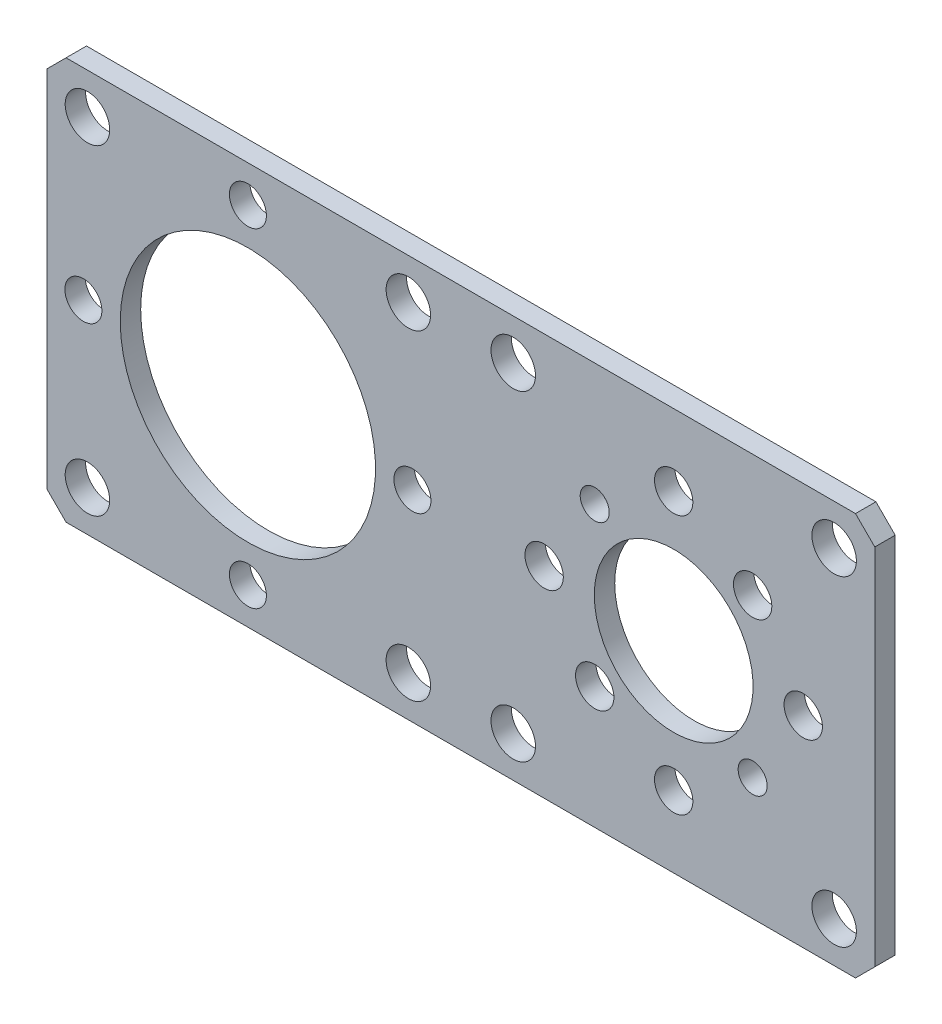
ISO-10303-21;
HEADER;
FILE_DESCRIPTION(('STEP AP214'),'2;1');
FILE_NAME('part.step','',(''),(''),'','','');
FILE_SCHEMA(('AUTOMOTIVE_DESIGN { 1 0 10303 214 1 1 1 1 }'));
ENDSEC;
DATA;
#1=APPLICATION_CONTEXT('core data for automotive mechanical design processes');
#2=APPLICATION_PROTOCOL_DEFINITION('international standard','automotive_design',2000,#1);
#3=PRODUCT_CONTEXT('',#1,'mechanical');
#4=PRODUCT('Part','Part','',(#3));
#5=PRODUCT_RELATED_PRODUCT_CATEGORY('part','',(#4));
#6=PRODUCT_DEFINITION_FORMATION('','',#4);
#7=PRODUCT_DEFINITION_CONTEXT('part definition',#1,'design');
#8=PRODUCT_DEFINITION('design','',#6,#7);
#9=PRODUCT_DEFINITION_SHAPE('','',#8);
#10=(LENGTH_UNIT() NAMED_UNIT(*) SI_UNIT(.MILLI.,.METRE.));
#11=(NAMED_UNIT(*) PLANE_ANGLE_UNIT() SI_UNIT($,.RADIAN.));
#12=(NAMED_UNIT(*) SI_UNIT($,.STERADIAN.) SOLID_ANGLE_UNIT());
#13=UNCERTAINTY_MEASURE_WITH_UNIT(LENGTH_MEASURE(1.E-05),#10,'distance_accuracy_value','');
#14=(GEOMETRIC_REPRESENTATION_CONTEXT(3) GLOBAL_UNCERTAINTY_ASSIGNED_CONTEXT((#13)) GLOBAL_UNIT_ASSIGNED_CONTEXT((#10,
#11,#12)) REPRESENTATION_CONTEXT('',''));
#15=CARTESIAN_POINT('',(0.,0.,0.));
#16=DIRECTION('',(0.,0.,1.));
#17=DIRECTION('',(1.,0.,0.));
#18=AXIS2_PLACEMENT_3D('',#15,#16,#17);
#19=CARTESIAN_POINT('',(-46.34075,22.51075,2.286));
#20=DIRECTION('',(0.,0.,1.));
#21=DIRECTION('',(1.,0.,0.));
#22=AXIS2_PLACEMENT_3D('',#19,#20,#21);
#23=PLANE('',#22);
#24=CARTESIAN_POINT('',(23.83,0.,2.286));
#25=DIRECTION('',(0.,0.,-1.));
#26=DIRECTION('',(-1.,0.,0.));
#27=AXIS2_PLACEMENT_3D('',#24,#25,#26);
#28=CIRCLE('',#27,8.88746);
#29=CARTESIAN_POINT('',(14.94254,0.,2.286));
#30=VERTEX_POINT('',#29);
#31=EDGE_CURVE('E167',#30,#30,#28,.T.);
#32=ORIENTED_EDGE('',*,*,#31,.T.);
#33=EDGE_LOOP('',(#32));
#34=FACE_BOUND('',#33,.T.);
#35=CARTESIAN_POINT('',(-23.83,0.,2.286));
#36=DIRECTION('',(0.,0.,-1.));
#37=DIRECTION('',(-1.,0.,0.));
#38=AXIS2_PLACEMENT_3D('',#35,#36,#37);
#39=CIRCLE('',#38,14.2875);
#40=CARTESIAN_POINT('',(-38.1175,0.,2.286));
#41=VERTEX_POINT('',#40);
#42=EDGE_CURVE('E170',#41,#41,#39,.T.);
#43=ORIENTED_EDGE('',*,*,#42,.T.);
#44=EDGE_LOOP('',(#43));
#45=FACE_BOUND('',#44,.T.);
#46=CARTESIAN_POINT('',(41.7905122421,17.9605122421,2.286));
#47=DIRECTION('',(0.,0.,1.));
#48=DIRECTION('',(1.,0.,0.));
#49=AXIS2_PLACEMENT_3D('',#46,#47,#48);
#50=CIRCLE('',#49,2.4892);
#51=CARTESIAN_POINT('',(44.2797122421,17.9605122421,2.286));
#52=VERTEX_POINT('',#51);
#53=EDGE_CURVE('E173',#52,#52,#50,.F.);
#54=ORIENTED_EDGE('',*,*,#53,.T.);
#55=EDGE_LOOP('',(#54));
#56=FACE_BOUND('',#55,.T.);
#57=CARTESIAN_POINT('',(41.7905122421,-17.9605122421,2.286));
#58=DIRECTION('',(0.,0.,1.));
#59=DIRECTION('',(1.,0.,0.));
#60=AXIS2_PLACEMENT_3D('',#57,#58,#59);
#61=CIRCLE('',#60,2.4892);
#62=CARTESIAN_POINT('',(44.2797122421,-17.9605122421,2.286));
#63=VERTEX_POINT('',#62);
#64=EDGE_CURVE('E176',#63,#63,#61,.F.);
#65=ORIENTED_EDGE('',*,*,#64,.T.);
#66=EDGE_LOOP('',(#65));
#67=FACE_BOUND('',#66,.T.);
#68=CARTESIAN_POINT('',(5.86948775786,-17.9605122421,2.286));
#69=DIRECTION('',(0.,0.,1.));
#70=DIRECTION('',(1.,0.,0.));
#71=AXIS2_PLACEMENT_3D('',#68,#69,#70);
#72=CIRCLE('',#71,2.4892);
#73=CARTESIAN_POINT('',(8.35868775786,-17.9605122421,2.286));
#74=VERTEX_POINT('',#73);
#75=EDGE_CURVE('E179',#74,#74,#72,.F.);
#76=ORIENTED_EDGE('',*,*,#75,.T.);
#77=EDGE_LOOP('',(#76));
#78=FACE_BOUND('',#77,.T.);
#79=CARTESIAN_POINT('',(5.86948775786,17.9605122421,2.286));
#80=DIRECTION('',(0.,0.,1.));
#81=DIRECTION('',(1.,0.,0.));
#82=AXIS2_PLACEMENT_3D('',#79,#80,#81);
#83=CIRCLE('',#82,2.4892);
#84=CARTESIAN_POINT('',(8.35868775786,17.9605122421,2.286));
#85=VERTEX_POINT('',#84);
#86=EDGE_CURVE('E182',#85,#85,#83,.F.);
#87=ORIENTED_EDGE('',*,*,#86,.T.);
#88=EDGE_LOOP('',(#87));
#89=FACE_BOUND('',#88,.T.);
#90=CARTESIAN_POINT('',(-41.7905122421,-17.9605122421,2.286));
#91=DIRECTION('',(0.,0.,1.));
#92=DIRECTION('',(1.,0.,0.));
#93=AXIS2_PLACEMENT_3D('',#90,#91,#92);
#94=CIRCLE('',#93,2.4892);
#95=CARTESIAN_POINT('',(-39.3013122421,-17.9605122421,2.286));
#96=VERTEX_POINT('',#95);
#97=EDGE_CURVE('E185',#96,#96,#94,.F.);
#98=ORIENTED_EDGE('',*,*,#97,.T.);
#99=EDGE_LOOP('',(#98));
#100=FACE_BOUND('',#99,.T.);
#101=CARTESIAN_POINT('',(-5.86948775786,17.9605122421,2.286));
#102=DIRECTION('',(0.,0.,1.));
#103=DIRECTION('',(1.,0.,0.));
#104=AXIS2_PLACEMENT_3D('',#101,#102,#103);
#105=CIRCLE('',#104,2.4892);
#106=CARTESIAN_POINT('',(-3.38028775786,17.9605122421,2.286));
#107=VERTEX_POINT('',#106);
#108=EDGE_CURVE('E188',#107,#107,#105,.F.);
#109=ORIENTED_EDGE('',*,*,#108,.T.);
#110=EDGE_LOOP('',(#109));
#111=FACE_BOUND('',#110,.T.);
#112=CARTESIAN_POINT('',(-5.86948775786,-17.9605122421,2.286));
#113=DIRECTION('',(0.,0.,1.));
#114=DIRECTION('',(1.,0.,0.));
#115=AXIS2_PLACEMENT_3D('',#112,#113,#114);
#116=CIRCLE('',#115,2.4892);
#117=CARTESIAN_POINT('',(-3.38028775786,-17.9605122421,2.286));
#118=VERTEX_POINT('',#117);
#119=EDGE_CURVE('E191',#118,#118,#116,.F.);
#120=ORIENTED_EDGE('',*,*,#119,.T.);
#121=EDGE_LOOP('',(#120));
#122=FACE_BOUND('',#121,.T.);
#123=CARTESIAN_POINT('',(-41.7905122421,17.9605122421,2.286));
#124=DIRECTION('',(0.,0.,1.));
#125=DIRECTION('',(1.,0.,0.));
#126=AXIS2_PLACEMENT_3D('',#123,#124,#125);
#127=CIRCLE('',#126,2.4892);
#128=CARTESIAN_POINT('',(-39.3013122421,17.9605122421,2.286));
#129=VERTEX_POINT('',#128);
#130=EDGE_CURVE('E194',#129,#129,#127,.F.);
#131=ORIENTED_EDGE('',*,*,#130,.T.);
#132=EDGE_LOOP('',(#131));
#133=FACE_BOUND('',#132,.T.);
#134=CARTESIAN_POINT('',(23.83,-14.5,2.286));
#135=DIRECTION('',(0.,0.,1.));
#136=DIRECTION('',(1.,0.,0.));
#137=AXIS2_PLACEMENT_3D('',#134,#135,#136);
#138=CIRCLE('',#137,2.1463);
#139=CARTESIAN_POINT('',(25.9763,-14.5,2.286));
#140=VERTEX_POINT('',#139);
#141=EDGE_CURVE('E197',#140,#140,#138,.F.);
#142=ORIENTED_EDGE('',*,*,#141,.T.);
#143=EDGE_LOOP('',(#142));
#144=FACE_BOUND('',#143,.T.);
#145=CARTESIAN_POINT('',(38.33,0.,2.286));
#146=DIRECTION('',(0.,0.,1.));
#147=DIRECTION('',(1.,0.,0.));
#148=AXIS2_PLACEMENT_3D('',#145,#146,#147);
#149=CIRCLE('',#148,2.1463);
#150=CARTESIAN_POINT('',(40.4763,0.,2.286));
#151=VERTEX_POINT('',#150);
#152=EDGE_CURVE('E200',#151,#151,#149,.F.);
#153=ORIENTED_EDGE('',*,*,#152,.T.);
#154=EDGE_LOOP('',(#153));
#155=FACE_BOUND('',#154,.T.);
#156=CARTESIAN_POINT('',(23.83,14.5,2.286));
#157=DIRECTION('',(0.,0.,1.));
#158=DIRECTION('',(1.,0.,0.));
#159=AXIS2_PLACEMENT_3D('',#156,#157,#158);
#160=CIRCLE('',#159,2.1463);
#161=CARTESIAN_POINT('',(25.9763,14.5,2.286));
#162=VERTEX_POINT('',#161);
#163=EDGE_CURVE('E203',#162,#162,#160,.F.);
#164=ORIENTED_EDGE('',*,*,#163,.T.);
#165=EDGE_LOOP('',(#164));
#166=FACE_BOUND('',#165,.T.);
#167=CARTESIAN_POINT('',(9.33,0.,2.286));
#168=DIRECTION('',(0.,0.,1.));
#169=DIRECTION('',(1.,0.,0.));
#170=AXIS2_PLACEMENT_3D('',#167,#168,#169);
#171=CIRCLE('',#170,2.1463);
#172=CARTESIAN_POINT('',(11.4763,0.,2.286));
#173=VERTEX_POINT('',#172);
#174=EDGE_CURVE('E206',#173,#173,#171,.F.);
#175=ORIENTED_EDGE('',*,*,#174,.T.);
#176=EDGE_LOOP('',(#175));
#177=FACE_BOUND('',#176,.T.);
#178=CARTESIAN_POINT('',(14.9911652352,8.83883476483,2.286));
#179=DIRECTION('',(0.,0.,1.));
#180=DIRECTION('',(1.,0.,0.));
#181=AXIS2_PLACEMENT_3D('',#178,#179,#180);
#182=CIRCLE('',#181,1.6256);
#183=CARTESIAN_POINT('',(16.6167652352,8.83883476483,2.286));
#184=VERTEX_POINT('',#183);
#185=EDGE_CURVE('E209',#184,#184,#182,.F.);
#186=ORIENTED_EDGE('',*,*,#185,.T.);
#187=EDGE_LOOP('',(#186));
#188=FACE_BOUND('',#187,.T.);
#189=CARTESIAN_POINT('',(32.6688347648,-8.83883476483,2.286));
#190=DIRECTION('',(0.,0.,1.));
#191=DIRECTION('',(1.,0.,0.));
#192=AXIS2_PLACEMENT_3D('',#189,#190,#191);
#193=CIRCLE('',#192,1.6256);
#194=CARTESIAN_POINT('',(34.2944347648,-8.83883476483,2.286));
#195=VERTEX_POINT('',#194);
#196=EDGE_CURVE('E212',#195,#195,#193,.F.);
#197=ORIENTED_EDGE('',*,*,#196,.T.);
#198=EDGE_LOOP('',(#197));
#199=FACE_BOUND('',#198,.T.);
#200=CARTESIAN_POINT('',(14.9911652352,-8.83883476483,2.286));
#201=DIRECTION('',(0.,0.,1.));
#202=DIRECTION('',(1.,0.,0.));
#203=AXIS2_PLACEMENT_3D('',#200,#201,#202);
#204=CIRCLE('',#203,2.1463);
#205=CARTESIAN_POINT('',(17.1374652352,-8.83883476483,2.286));
#206=VERTEX_POINT('',#205);
#207=EDGE_CURVE('E215',#206,#206,#204,.F.);
#208=ORIENTED_EDGE('',*,*,#207,.T.);
#209=EDGE_LOOP('',(#208));
#210=FACE_BOUND('',#209,.T.);
#211=CARTESIAN_POINT('',(32.6688347648,8.83883476483,2.286));
#212=DIRECTION('',(0.,0.,1.));
#213=DIRECTION('',(1.,0.,0.));
#214=AXIS2_PLACEMENT_3D('',#211,#212,#213);
#215=CIRCLE('',#214,2.1463);
#216=CARTESIAN_POINT('',(34.8151347648,8.83883476483,2.286));
#217=VERTEX_POINT('',#216);
#218=EDGE_CURVE('E218',#217,#217,#215,.F.);
#219=ORIENTED_EDGE('',*,*,#218,.T.);
#220=EDGE_LOOP('',(#219));
#221=FACE_BOUND('',#220,.T.);
#222=CARTESIAN_POINT('',(-23.83,-18.415,2.286));
#223=DIRECTION('',(0.,0.,1.));
#224=DIRECTION('',(1.,0.,0.));
#225=AXIS2_PLACEMENT_3D('',#222,#223,#224);
#226=CIRCLE('',#225,2.0701);
#227=CARTESIAN_POINT('',(-21.7599,-18.415,2.286));
#228=VERTEX_POINT('',#227);
#229=EDGE_CURVE('E221',#228,#228,#226,.F.);
#230=ORIENTED_EDGE('',*,*,#229,.T.);
#231=EDGE_LOOP('',(#230));
#232=FACE_BOUND('',#231,.T.);
#233=CARTESIAN_POINT('',(-23.83,18.415,2.286));
#234=DIRECTION('',(0.,0.,1.));
#235=DIRECTION('',(1.,0.,0.));
#236=AXIS2_PLACEMENT_3D('',#233,#234,#235);
#237=CIRCLE('',#236,2.0701);
#238=CARTESIAN_POINT('',(-21.7599,18.415,2.286));
#239=VERTEX_POINT('',#238);
#240=EDGE_CURVE('E224',#239,#239,#237,.F.);
#241=ORIENTED_EDGE('',*,*,#240,.T.);
#242=EDGE_LOOP('',(#241));
#243=FACE_BOUND('',#242,.T.);
#244=CARTESIAN_POINT('',(-5.415,0.,2.286));
#245=DIRECTION('',(0.,0.,1.));
#246=DIRECTION('',(1.,0.,0.));
#247=AXIS2_PLACEMENT_3D('',#244,#245,#246);
#248=CIRCLE('',#247,2.0701);
#249=CARTESIAN_POINT('',(-3.3449,0.,2.286));
#250=VERTEX_POINT('',#249);
#251=EDGE_CURVE('E226',#250,#250,#248,.F.);
#252=ORIENTED_EDGE('',*,*,#251,.T.);
#253=EDGE_LOOP('',(#252));
#254=FACE_BOUND('',#253,.T.);
#255=CARTESIAN_POINT('',(-42.245,0.,2.286));
#256=DIRECTION('',(0.,0.,1.));
#257=DIRECTION('',(1.,0.,0.));
#258=AXIS2_PLACEMENT_3D('',#255,#256,#257);
#259=CIRCLE('',#258,2.0701);
#260=CARTESIAN_POINT('',(-40.1749,0.,2.286));
#261=VERTEX_POINT('',#260);
#262=EDGE_CURVE('E20',#261,#261,#259,.F.);
#263=ORIENTED_EDGE('',*,*,#262,.T.);
#264=EDGE_LOOP('',(#263));
#265=FACE_BOUND('',#264,.T.);
#266=DIRECTION('',(0.,1.,0.));
#267=VECTOR('',#266,1.);
#268=CARTESIAN_POINT('',(-46.34075,22.51075,2.286));
#269=LINE('',#268,#267);
#270=CARTESIAN_POINT('',(-46.34075,20.35175,2.286));
#271=VERTEX_POINT('',#270);
#272=CARTESIAN_POINT('',(-46.3407499999125,-20.3517500006125,2.286));
#273=VERTEX_POINT('',#272);
#274=EDGE_CURVE('E255',#271,#273,#269,.F.);
#275=ORIENTED_EDGE('',*,*,#274,.T.);
#276=DIRECTION('',(-0.707106781186548,0.707106781186548,0.));
#277=VECTOR('',#276,1.);
#278=CARTESIAN_POINT('',(-44.18175,-22.51075,2.286));
#279=LINE('',#278,#277);
#280=CARTESIAN_POINT('',(-44.18175,-22.51075,2.286));
#281=VERTEX_POINT('',#280);
#282=EDGE_CURVE('E250',#273,#281,#279,.F.);
#283=ORIENTED_EDGE('',*,*,#282,.T.);
#284=DIRECTION('',(-1.,0.,0.));
#285=VECTOR('',#284,1.);
#286=CARTESIAN_POINT('',(-46.34075,-22.51075,2.286));
#287=LINE('',#286,#285);
#288=CARTESIAN_POINT('',(44.1817500007875,-22.5107499998875,2.286));
#289=VERTEX_POINT('',#288);
#290=EDGE_CURVE('E245',#281,#289,#287,.F.);
#291=ORIENTED_EDGE('',*,*,#290,.T.);
#292=DIRECTION('',(-0.707106781186548,-0.707106781186548,0.));
#293=VECTOR('',#292,1.);
#294=CARTESIAN_POINT('',(46.34075,-20.35175,2.286));
#295=LINE('',#294,#293);
#296=CARTESIAN_POINT('',(46.340749999825,-20.351750000525,2.286));
#297=VERTEX_POINT('',#296);
#298=EDGE_CURVE('E240',#289,#297,#295,.F.);
#299=ORIENTED_EDGE('',*,*,#298,.T.);
#300=DIRECTION('',(0.,1.,0.));
#301=VECTOR('',#300,1.);
#302=CARTESIAN_POINT('',(46.34075,22.51075,2.286));
#303=LINE('',#302,#301);
#304=CARTESIAN_POINT('',(46.34075,20.35175,2.286));
#305=VERTEX_POINT('',#304);
#306=EDGE_CURVE('E84',#297,#305,#303,.T.);
#307=ORIENTED_EDGE('',*,*,#306,.T.);
#308=DIRECTION('',(0.707106781186548,-0.707106781186548,0.));
#309=VECTOR('',#308,1.);
#310=CARTESIAN_POINT('',(44.18175,22.51075,2.286));
#311=LINE('',#310,#309);
#312=CARTESIAN_POINT('',(44.181750000675,22.510749999775,2.286));
#313=VERTEX_POINT('',#312);
#314=EDGE_CURVE('E83',#305,#313,#311,.F.);
#315=ORIENTED_EDGE('',*,*,#314,.T.);
#316=DIRECTION('',(1.,0.,0.));
#317=VECTOR('',#316,1.);
#318=CARTESIAN_POINT('',(-46.34075,22.51075,2.286));
#319=LINE('',#318,#317);
#320=CARTESIAN_POINT('',(-44.18175,22.51075,2.286));
#321=VERTEX_POINT('',#320);
#322=EDGE_CURVE('E80',#313,#321,#319,.F.);
#323=ORIENTED_EDGE('',*,*,#322,.T.);
#324=DIRECTION('',(0.707106781186548,0.707106781186548,0.));
#325=VECTOR('',#324,1.);
#326=CARTESIAN_POINT('',(-46.34075,20.35175,2.286));
#327=LINE('',#326,#325);
#328=EDGE_CURVE('E260',#321,#271,#327,.F.);
#329=ORIENTED_EDGE('',*,*,#328,.T.);
#330=EDGE_LOOP('',(#275,#283,#291,#299,#307,#315,#323,#329));
#331=FACE_BOUND('',#330,.T.);
#332=ADVANCED_FACE('F17',(#34,#45,#56,#67,#78,#89,#100,#111,#122,#133,#144,#155,#166,#177,#188,
#199,#210,#221,#232,#243,#254,#265,#331),#23,.T.);
#333=CARTESIAN_POINT('',(44.18175,22.51075,2.286));
#334=DIRECTION('',(-0.707106781186548,-0.707106781186548,0.));
#335=DIRECTION('',(0.707106781186548,-0.707106781186548,0.));
#336=AXIS2_PLACEMENT_3D('',#333,#334,#335);
#337=PLANE('',#336);
#338=DIRECTION('',(0.,0.,1.));
#339=VECTOR('',#338,1.);
#340=CARTESIAN_POINT('',(46.34075,20.35175,2.286));
#341=LINE('',#340,#339);
#342=CARTESIAN_POINT('',(46.34075,20.35175,-2.34694100091637E-10));
#343=VERTEX_POINT('',#342);
#344=EDGE_CURVE('E234',#305,#343,#341,.F.);
#345=ORIENTED_EDGE('',*,*,#344,.T.);
#346=DIRECTION('',(-0.707106781039163,0.707106781333932,0.));
#347=VECTOR('',#346,1.);
#348=CARTESIAN_POINT('',(46.34075,20.35175,0.));
#349=LINE('',#348,#347);
#350=CARTESIAN_POINT('',(44.181750000675,22.510749999775,-2.34693883251202E-10));
#351=VERTEX_POINT('',#350);
#352=EDGE_CURVE('E100',#343,#351,#349,.T.);
#353=ORIENTED_EDGE('',*,*,#352,.T.);
#354=DIRECTION('',(0.,0.,1.));
#355=VECTOR('',#354,1.);
#356=CARTESIAN_POINT('',(44.1817500009,22.51075,2.286));
#357=LINE('',#356,#355);
#358=EDGE_CURVE('E89',#351,#313,#357,.T.);
#359=ORIENTED_EDGE('',*,*,#358,.T.);
#360=ORIENTED_EDGE('',*,*,#314,.F.);
#361=EDGE_LOOP('',(#345,#353,#359,#360));
#362=FACE_BOUND('',#361,.T.);
#363=ADVANCED_FACE('F99',(#362),#337,.F.);
#364=CARTESIAN_POINT('',(-46.34075,22.51075,2.286));
#365=DIRECTION('',(0.,-1.,0.));
#366=DIRECTION('',(1.,0.,0.));
#367=AXIS2_PLACEMENT_3D('',#364,#365,#366);
#368=PLANE('',#367);
#369=ORIENTED_EDGE('',*,*,#358,.F.);
#370=DIRECTION('',(1.,0.,0.));
#371=VECTOR('',#370,1.);
#372=CARTESIAN_POINT('',(-46.34075,22.51075,0.));
#373=LINE('',#372,#371);
#374=CARTESIAN_POINT('',(-44.18175,22.51075,-2.34693774830985E-10));
#375=VERTEX_POINT('',#374);
#376=EDGE_CURVE('E274',#351,#375,#373,.F.);
#377=ORIENTED_EDGE('',*,*,#376,.T.);
#378=DIRECTION('',(0.,0.,1.));
#379=VECTOR('',#378,1.);
#380=CARTESIAN_POINT('',(-44.18175,22.51075,2.286));
#381=LINE('',#380,#379);
#382=EDGE_CURVE('E96',#375,#321,#381,.T.);
#383=ORIENTED_EDGE('',*,*,#382,.T.);
#384=ORIENTED_EDGE('',*,*,#322,.F.);
#385=EDGE_LOOP('',(#369,#377,#383,#384));
#386=FACE_BOUND('',#385,.T.);
#387=ADVANCED_FACE('F93',(#386),#368,.F.);
#388=CARTESIAN_POINT('',(-46.34075,20.35175,2.286));
#389=DIRECTION('',(0.707106781186548,-0.707106781186548,0.));
#390=DIRECTION('',(0.707106781186548,0.707106781186548,0.));
#391=AXIS2_PLACEMENT_3D('',#388,#389,#390);
#392=PLANE('',#391);
#393=ORIENTED_EDGE('',*,*,#382,.F.);
#394=DIRECTION('',(-0.707106781186547,-0.707106781186548,0.));
#395=VECTOR('',#394,1.);
#396=CARTESIAN_POINT('',(-44.18175,22.51075,0.));
#397=LINE('',#396,#395);
#398=CARTESIAN_POINT('',(-46.34075,20.35175,-2.34693883251202E-10));
#399=VERTEX_POINT('',#398);
#400=EDGE_CURVE('E271',#375,#399,#397,.T.);
#401=ORIENTED_EDGE('',*,*,#400,.T.);
#402=DIRECTION('',(0.,0.,-1.));
#403=VECTOR('',#402,1.);
#404=CARTESIAN_POINT('',(-46.34075,20.35175,2.286));
#405=LINE('',#404,#403);
#406=EDGE_CURVE('E257',#399,#271,#405,.F.);
#407=ORIENTED_EDGE('',*,*,#406,.T.);
#408=ORIENTED_EDGE('',*,*,#328,.F.);
#409=EDGE_LOOP('',(#393,#401,#407,#408));
#410=FACE_BOUND('',#409,.T.);
#411=ADVANCED_FACE('F269',(#410),#392,.F.);
#412=CARTESIAN_POINT('',(-46.34075,22.51075,2.286));
#413=DIRECTION('',(1.,0.,0.));
#414=DIRECTION('',(0.,0.,-1.));
#415=AXIS2_PLACEMENT_3D('',#412,#413,#414);
#416=PLANE('',#415);
#417=DIRECTION('',(0.,0.,1.));
#418=VECTOR('',#417,1.);
#419=CARTESIAN_POINT('',(-46.34074999965,-20.35175000035,2.286));
#420=LINE('',#419,#418);
#421=CARTESIAN_POINT('',(-46.3407499999125,-20.3517500006125,-2.34693774830985E-10));
#422=VERTEX_POINT('',#421);
#423=EDGE_CURVE('E252',#422,#273,#420,.T.);
#424=ORIENTED_EDGE('',*,*,#423,.T.);
#425=ORIENTED_EDGE('',*,*,#274,.F.);
#426=ORIENTED_EDGE('',*,*,#406,.F.);
#427=DIRECTION('',(0.,1.,0.));
#428=VECTOR('',#427,1.);
#429=CARTESIAN_POINT('',(-46.34075,22.51075,0.));
#430=LINE('',#429,#428);
#431=EDGE_CURVE('E273',#399,#422,#430,.F.);
#432=ORIENTED_EDGE('',*,*,#431,.T.);
#433=EDGE_LOOP('',(#424,#425,#426,#432));
#434=FACE_BOUND('',#433,.T.);
#435=ADVANCED_FACE('F265',(#434),#416,.F.);
#436=CARTESIAN_POINT('',(-44.18175,-22.51075,2.286));
#437=DIRECTION('',(0.707106781186548,0.707106781186548,0.));
#438=DIRECTION('',(-0.707106781186548,0.707106781186548,0.));
#439=AXIS2_PLACEMENT_3D('',#436,#437,#438);
#440=PLANE('',#439);
#441=ORIENTED_EDGE('',*,*,#423,.F.);
#442=DIRECTION('',(0.707106781301178,-0.707106781071916,0.));
#443=VECTOR('',#442,1.);
#444=CARTESIAN_POINT('',(-46.34075,-20.3517500007,0.));
#445=LINE('',#444,#443);
#446=CARTESIAN_POINT('',(-44.18175,-22.51075,-2.34693883251202E-10));
#447=VERTEX_POINT('',#446);
#448=EDGE_CURVE('E276',#422,#447,#445,.T.);
#449=ORIENTED_EDGE('',*,*,#448,.T.);
#450=DIRECTION('',(0.,0.,1.));
#451=VECTOR('',#450,1.);
#452=CARTESIAN_POINT('',(-44.18175,-22.51075,2.286));
#453=LINE('',#452,#451);
#454=EDGE_CURVE('E247',#447,#281,#453,.T.);
#455=ORIENTED_EDGE('',*,*,#454,.T.);
#456=ORIENTED_EDGE('',*,*,#282,.F.);
#457=EDGE_LOOP('',(#441,#449,#455,#456));
#458=FACE_BOUND('',#457,.T.);
#459=ADVANCED_FACE('F299',(#458),#440,.F.);
#460=CARTESIAN_POINT('',(-46.34075,-22.51075,2.286));
#461=DIRECTION('',(0.,1.,0.));
#462=DIRECTION('',(-1.,0.,0.));
#463=AXIS2_PLACEMENT_3D('',#460,#461,#462);
#464=PLANE('',#463);
#465=DIRECTION('',(0.,0.,1.));
#466=VECTOR('',#465,1.);
#467=CARTESIAN_POINT('',(44.18175000045,-22.51074999955,2.286));
#468=LINE('',#467,#466);
#469=CARTESIAN_POINT('',(44.1817500007875,-22.5107499998875,-2.34693774830985E-10));
#470=VERTEX_POINT('',#469);
#471=EDGE_CURVE('E242',#470,#289,#468,.T.);
#472=ORIENTED_EDGE('',*,*,#471,.T.);
#473=ORIENTED_EDGE('',*,*,#290,.F.);
#474=ORIENTED_EDGE('',*,*,#454,.F.);
#475=DIRECTION('',(1.,0.,0.));
#476=VECTOR('',#475,1.);
#477=CARTESIAN_POINT('',(-46.34075,-22.51075,0.));
#478=LINE('',#477,#476);
#479=EDGE_CURVE('E281',#447,#470,#478,.T.);
#480=ORIENTED_EDGE('',*,*,#479,.T.);
#481=EDGE_LOOP('',(#472,#473,#474,#480));
#482=FACE_BOUND('',#481,.T.);
#483=ADVANCED_FACE('F296',(#482),#464,.F.);
#484=CARTESIAN_POINT('',(46.34075,-20.35175,2.286));
#485=DIRECTION('',(-0.707106781186548,0.707106781186548,0.));
#486=DIRECTION('',(-0.707106781186548,-0.707106781186548,0.));
#487=AXIS2_PLACEMENT_3D('',#484,#485,#486);
#488=PLANE('',#487);
#489=ORIENTED_EDGE('',*,*,#471,.F.);
#490=DIRECTION('',(0.707106781153795,0.7071067812193,0.));
#491=VECTOR('',#490,1.);
#492=CARTESIAN_POINT('',(44.1817500009,-22.51075,0.));
#493=LINE('',#492,#491);
#494=CARTESIAN_POINT('',(46.340749999825,-20.351750000525,-2.34693883251202E-10));
#495=VERTEX_POINT('',#494);
#496=EDGE_CURVE('E284',#470,#495,#493,.T.);
#497=ORIENTED_EDGE('',*,*,#496,.T.);
#498=DIRECTION('',(0.,0.,1.));
#499=VECTOR('',#498,1.);
#500=CARTESIAN_POINT('',(46.34075,-20.3517500007,2.286));
#501=LINE('',#500,#499);
#502=EDGE_CURVE('E35',#495,#297,#501,.T.);
#503=ORIENTED_EDGE('',*,*,#502,.T.);
#504=ORIENTED_EDGE('',*,*,#298,.F.);
#505=EDGE_LOOP('',(#489,#497,#503,#504));
#506=FACE_BOUND('',#505,.T.);
#507=ADVANCED_FACE('F292',(#506),#488,.F.);
#508=CARTESIAN_POINT('',(46.34075,22.51075,2.286));
#509=DIRECTION('',(-1.,0.,0.));
#510=DIRECTION('',(0.,0.,1.));
#511=AXIS2_PLACEMENT_3D('',#508,#509,#510);
#512=PLANE('',#511);
#513=ORIENTED_EDGE('',*,*,#502,.F.);
#514=DIRECTION('',(0.,1.,0.));
#515=VECTOR('',#514,1.);
#516=CARTESIAN_POINT('',(46.34075,22.51075,0.));
#517=LINE('',#516,#515);
#518=EDGE_CURVE('E166',#495,#343,#517,.T.);
#519=ORIENTED_EDGE('',*,*,#518,.T.);
#520=ORIENTED_EDGE('',*,*,#344,.F.);
#521=ORIENTED_EDGE('',*,*,#306,.F.);
#522=EDGE_LOOP('',(#513,#519,#520,#521));
#523=FACE_BOUND('',#522,.T.);
#524=ADVANCED_FACE('F287',(#523),#512,.F.);
#525=CARTESIAN_POINT('',(-42.245,0.,2.286));
#526=DIRECTION('',(0.,0.,1.));
#527=DIRECTION('',(1.,0.,0.));
#528=AXIS2_PLACEMENT_3D('',#525,#526,#527);
#529=CYLINDRICAL_SURFACE('',#528,2.0701);
#530=CARTESIAN_POINT('',(-42.245,0.,-3.12924599427111E-10));
#531=DIRECTION('',(0.,0.,1.));
#532=DIRECTION('',(1.,0.,0.));
#533=AXIS2_PLACEMENT_3D('',#530,#531,#532);
#534=CIRCLE('',#533,2.0701);
#535=CARTESIAN_POINT('',(-40.1749,0.,-3.12924599427111E-10));
#536=VERTEX_POINT('',#535);
#537=EDGE_CURVE('E163',#536,#536,#534,.F.);
#538=ORIENTED_EDGE('',*,*,#537,.T.);
#539=EDGE_LOOP('',(#538));
#540=FACE_BOUND('',#539,.T.);
#541=ORIENTED_EDGE('',*,*,#262,.F.);
#542=EDGE_LOOP('',(#541));
#543=FACE_BOUND('',#542,.T.);
#544=ADVANCED_FACE('F400',(#540,#543),#529,.F.);
#545=CARTESIAN_POINT('',(-5.415,0.,2.286));
#546=DIRECTION('',(0.,0.,1.));
#547=DIRECTION('',(1.,0.,0.));
#548=AXIS2_PLACEMENT_3D('',#545,#546,#547);
#549=CYLINDRICAL_SURFACE('',#548,2.0701);
#550=CARTESIAN_POINT('',(-5.415,0.,-3.12924599427111E-10));
#551=DIRECTION('',(0.,0.,1.));
#552=DIRECTION('',(1.,0.,0.));
#553=AXIS2_PLACEMENT_3D('',#550,#551,#552);
#554=CIRCLE('',#553,2.0701);
#555=CARTESIAN_POINT('',(-3.3449,0.,-3.12924599427111E-10));
#556=VERTEX_POINT('',#555);
#557=EDGE_CURVE('E160',#556,#556,#554,.F.);
#558=ORIENTED_EDGE('',*,*,#557,.T.);
#559=EDGE_LOOP('',(#558));
#560=FACE_BOUND('',#559,.T.);
#561=ORIENTED_EDGE('',*,*,#251,.F.);
#562=EDGE_LOOP('',(#561));
#563=FACE_BOUND('',#562,.T.);
#564=ADVANCED_FACE('F396',(#560,#563),#549,.F.);
#565=CARTESIAN_POINT('',(-23.83,18.415,2.286));
#566=DIRECTION('',(0.,0.,1.));
#567=DIRECTION('',(1.,0.,0.));
#568=AXIS2_PLACEMENT_3D('',#565,#566,#567);
#569=CYLINDRICAL_SURFACE('',#568,2.0701);
#570=CARTESIAN_POINT('',(-23.83,18.415,-3.12924599427111E-10));
#571=DIRECTION('',(0.,0.,1.));
#572=DIRECTION('',(1.,0.,0.));
#573=AXIS2_PLACEMENT_3D('',#570,#571,#572);
#574=CIRCLE('',#573,2.0701);
#575=CARTESIAN_POINT('',(-21.7599,18.415,-3.12924599427111E-10));
#576=VERTEX_POINT('',#575);
#577=EDGE_CURVE('E157',#576,#576,#574,.F.);
#578=ORIENTED_EDGE('',*,*,#577,.T.);
#579=EDGE_LOOP('',(#578));
#580=FACE_BOUND('',#579,.T.);
#581=ORIENTED_EDGE('',*,*,#240,.F.);
#582=EDGE_LOOP('',(#581));
#583=FACE_BOUND('',#582,.T.);
#584=ADVANCED_FACE('F392',(#580,#583),#569,.F.);
#585=CARTESIAN_POINT('',(-23.83,-18.415,2.286));
#586=DIRECTION('',(0.,0.,1.));
#587=DIRECTION('',(1.,0.,0.));
#588=AXIS2_PLACEMENT_3D('',#585,#586,#587);
#589=CYLINDRICAL_SURFACE('',#588,2.0701);
#590=CARTESIAN_POINT('',(-23.83,-18.415,-3.12924599427111E-10));
#591=DIRECTION('',(0.,0.,1.));
#592=DIRECTION('',(1.,0.,0.));
#593=AXIS2_PLACEMENT_3D('',#590,#591,#592);
#594=CIRCLE('',#593,2.0701);
#595=CARTESIAN_POINT('',(-21.7599,-18.415,-3.12924599427111E-10));
#596=VERTEX_POINT('',#595);
#597=EDGE_CURVE('E154',#596,#596,#594,.F.);
#598=ORIENTED_EDGE('',*,*,#597,.T.);
#599=EDGE_LOOP('',(#598));
#600=FACE_BOUND('',#599,.T.);
#601=ORIENTED_EDGE('',*,*,#229,.F.);
#602=EDGE_LOOP('',(#601));
#603=FACE_BOUND('',#602,.T.);
#604=ADVANCED_FACE('F388',(#600,#603),#589,.F.);
#605=CARTESIAN_POINT('',(32.6688347648,8.83883476483,2.286));
#606=DIRECTION('',(0.,0.,1.));
#607=DIRECTION('',(1.,0.,0.));
#608=AXIS2_PLACEMENT_3D('',#605,#606,#607);
#609=CYLINDRICAL_SURFACE('',#608,2.1463);
#610=CARTESIAN_POINT('',(32.6688347648,8.83883476483,-3.12924599427111E-10));
#611=DIRECTION('',(0.,0.,1.));
#612=DIRECTION('',(1.,0.,0.));
#613=AXIS2_PLACEMENT_3D('',#610,#611,#612);
#614=CIRCLE('',#613,2.1463);
#615=CARTESIAN_POINT('',(34.8151347648,8.83883476483,-3.12924599427111E-10));
#616=VERTEX_POINT('',#615);
#617=EDGE_CURVE('E151',#616,#616,#614,.F.);
#618=ORIENTED_EDGE('',*,*,#617,.T.);
#619=EDGE_LOOP('',(#618));
#620=FACE_BOUND('',#619,.T.);
#621=ORIENTED_EDGE('',*,*,#218,.F.);
#622=EDGE_LOOP('',(#621));
#623=FACE_BOUND('',#622,.T.);
#624=ADVANCED_FACE('F384',(#620,#623),#609,.F.);
#625=CARTESIAN_POINT('',(14.9911652352,-8.83883476483,2.286));
#626=DIRECTION('',(0.,0.,1.));
#627=DIRECTION('',(1.,0.,0.));
#628=AXIS2_PLACEMENT_3D('',#625,#626,#627);
#629=CYLINDRICAL_SURFACE('',#628,2.1463);
#630=CARTESIAN_POINT('',(14.9911652352,-8.83883476483,-3.12924599427111E-10));
#631=DIRECTION('',(0.,0.,1.));
#632=DIRECTION('',(1.,0.,0.));
#633=AXIS2_PLACEMENT_3D('',#630,#631,#632);
#634=CIRCLE('',#633,2.1463);
#635=CARTESIAN_POINT('',(17.1374652352,-8.83883476483,-3.12924599427111E-10));
#636=VERTEX_POINT('',#635);
#637=EDGE_CURVE('E148',#636,#636,#634,.F.);
#638=ORIENTED_EDGE('',*,*,#637,.T.);
#639=EDGE_LOOP('',(#638));
#640=FACE_BOUND('',#639,.T.);
#641=ORIENTED_EDGE('',*,*,#207,.F.);
#642=EDGE_LOOP('',(#641));
#643=FACE_BOUND('',#642,.T.);
#644=ADVANCED_FACE('F380',(#640,#643),#629,.F.);
#645=CARTESIAN_POINT('',(32.6688347648,-8.83883476483,2.286));
#646=DIRECTION('',(0.,0.,1.));
#647=DIRECTION('',(1.,0.,0.));
#648=AXIS2_PLACEMENT_3D('',#645,#646,#647);
#649=CYLINDRICAL_SURFACE('',#648,1.6256);
#650=CARTESIAN_POINT('',(32.6688347648,-8.83883476483,-3.12924599427111E-10));
#651=DIRECTION('',(0.,0.,1.));
#652=DIRECTION('',(1.,0.,0.));
#653=AXIS2_PLACEMENT_3D('',#650,#651,#652);
#654=CIRCLE('',#653,1.6256);
#655=CARTESIAN_POINT('',(34.2944347648,-8.83883476483,-3.12924599427111E-10));
#656=VERTEX_POINT('',#655);
#657=EDGE_CURVE('E145',#656,#656,#654,.F.);
#658=ORIENTED_EDGE('',*,*,#657,.T.);
#659=EDGE_LOOP('',(#658));
#660=FACE_BOUND('',#659,.T.);
#661=ORIENTED_EDGE('',*,*,#196,.F.);
#662=EDGE_LOOP('',(#661));
#663=FACE_BOUND('',#662,.T.);
#664=ADVANCED_FACE('F376',(#660,#663),#649,.F.);
#665=CARTESIAN_POINT('',(14.9911652352,8.83883476483,2.286));
#666=DIRECTION('',(0.,0.,1.));
#667=DIRECTION('',(1.,0.,0.));
#668=AXIS2_PLACEMENT_3D('',#665,#666,#667);
#669=CYLINDRICAL_SURFACE('',#668,1.6256);
#670=CARTESIAN_POINT('',(14.9911652352,8.83883476483,-3.12924599427111E-10));
#671=DIRECTION('',(0.,0.,1.));
#672=DIRECTION('',(1.,0.,0.));
#673=AXIS2_PLACEMENT_3D('',#670,#671,#672);
#674=CIRCLE('',#673,1.6256);
#675=CARTESIAN_POINT('',(16.6167652352,8.83883476483,-3.12924599427111E-10));
#676=VERTEX_POINT('',#675);
#677=EDGE_CURVE('E142',#676,#676,#674,.F.);
#678=ORIENTED_EDGE('',*,*,#677,.T.);
#679=EDGE_LOOP('',(#678));
#680=FACE_BOUND('',#679,.T.);
#681=ORIENTED_EDGE('',*,*,#185,.F.);
#682=EDGE_LOOP('',(#681));
#683=FACE_BOUND('',#682,.T.);
#684=ADVANCED_FACE('F372',(#680,#683),#669,.F.);
#685=CARTESIAN_POINT('',(9.33,0.,2.286));
#686=DIRECTION('',(0.,0.,1.));
#687=DIRECTION('',(1.,0.,0.));
#688=AXIS2_PLACEMENT_3D('',#685,#686,#687);
#689=CYLINDRICAL_SURFACE('',#688,2.1463);
#690=CARTESIAN_POINT('',(9.33,0.,-3.12924599427111E-10));
#691=DIRECTION('',(0.,0.,1.));
#692=DIRECTION('',(1.,0.,0.));
#693=AXIS2_PLACEMENT_3D('',#690,#691,#692);
#694=CIRCLE('',#693,2.1463);
#695=CARTESIAN_POINT('',(11.4763,0.,-3.12924599427111E-10));
#696=VERTEX_POINT('',#695);
#697=EDGE_CURVE('E139',#696,#696,#694,.F.);
#698=ORIENTED_EDGE('',*,*,#697,.T.);
#699=EDGE_LOOP('',(#698));
#700=FACE_BOUND('',#699,.T.);
#701=ORIENTED_EDGE('',*,*,#174,.F.);
#702=EDGE_LOOP('',(#701));
#703=FACE_BOUND('',#702,.T.);
#704=ADVANCED_FACE('F368',(#700,#703),#689,.F.);
#705=CARTESIAN_POINT('',(23.83,14.5,2.286));
#706=DIRECTION('',(0.,0.,1.));
#707=DIRECTION('',(1.,0.,0.));
#708=AXIS2_PLACEMENT_3D('',#705,#706,#707);
#709=CYLINDRICAL_SURFACE('',#708,2.1463);
#710=CARTESIAN_POINT('',(23.83,14.5,-3.12924599427111E-10));
#711=DIRECTION('',(0.,0.,1.));
#712=DIRECTION('',(1.,0.,0.));
#713=AXIS2_PLACEMENT_3D('',#710,#711,#712);
#714=CIRCLE('',#713,2.1463);
#715=CARTESIAN_POINT('',(25.9763,14.5,-3.12924599427111E-10));
#716=VERTEX_POINT('',#715);
#717=EDGE_CURVE('E136',#716,#716,#714,.F.);
#718=ORIENTED_EDGE('',*,*,#717,.T.);
#719=EDGE_LOOP('',(#718));
#720=FACE_BOUND('',#719,.T.);
#721=ORIENTED_EDGE('',*,*,#163,.F.);
#722=EDGE_LOOP('',(#721));
#723=FACE_BOUND('',#722,.T.);
#724=ADVANCED_FACE('F364',(#720,#723),#709,.F.);
#725=CARTESIAN_POINT('',(38.33,0.,2.286));
#726=DIRECTION('',(0.,0.,1.));
#727=DIRECTION('',(1.,0.,0.));
#728=AXIS2_PLACEMENT_3D('',#725,#726,#727);
#729=CYLINDRICAL_SURFACE('',#728,2.1463);
#730=CARTESIAN_POINT('',(38.33,0.,-3.12924599427111E-10));
#731=DIRECTION('',(0.,0.,1.));
#732=DIRECTION('',(1.,0.,0.));
#733=AXIS2_PLACEMENT_3D('',#730,#731,#732);
#734=CIRCLE('',#733,2.1463);
#735=CARTESIAN_POINT('',(40.4763,0.,-3.12924599427111E-10));
#736=VERTEX_POINT('',#735);
#737=EDGE_CURVE('E133',#736,#736,#734,.F.);
#738=ORIENTED_EDGE('',*,*,#737,.T.);
#739=EDGE_LOOP('',(#738));
#740=FACE_BOUND('',#739,.T.);
#741=ORIENTED_EDGE('',*,*,#152,.F.);
#742=EDGE_LOOP('',(#741));
#743=FACE_BOUND('',#742,.T.);
#744=ADVANCED_FACE('F360',(#740,#743),#729,.F.);
#745=CARTESIAN_POINT('',(23.83,-14.5,2.286));
#746=DIRECTION('',(0.,0.,1.));
#747=DIRECTION('',(1.,0.,0.));
#748=AXIS2_PLACEMENT_3D('',#745,#746,#747);
#749=CYLINDRICAL_SURFACE('',#748,2.1463);
#750=CARTESIAN_POINT('',(23.83,-14.5,-3.12924599427111E-10));
#751=DIRECTION('',(0.,0.,1.));
#752=DIRECTION('',(1.,0.,0.));
#753=AXIS2_PLACEMENT_3D('',#750,#751,#752);
#754=CIRCLE('',#753,2.1463);
#755=CARTESIAN_POINT('',(25.9763,-14.5,-3.12924599427111E-10));
#756=VERTEX_POINT('',#755);
#757=EDGE_CURVE('E130',#756,#756,#754,.F.);
#758=ORIENTED_EDGE('',*,*,#757,.T.);
#759=EDGE_LOOP('',(#758));
#760=FACE_BOUND('',#759,.T.);
#761=ORIENTED_EDGE('',*,*,#141,.F.);
#762=EDGE_LOOP('',(#761));
#763=FACE_BOUND('',#762,.T.);
#764=ADVANCED_FACE('F356',(#760,#763),#749,.F.);
#765=CARTESIAN_POINT('',(-41.7905122421,17.9605122421,2.286));
#766=DIRECTION('',(0.,0.,1.));
#767=DIRECTION('',(1.,0.,0.));
#768=AXIS2_PLACEMENT_3D('',#765,#766,#767);
#769=CYLINDRICAL_SURFACE('',#768,2.4892);
#770=CARTESIAN_POINT('',(-41.7905122421,17.9605122421,-3.12924599427111E-10));
#771=DIRECTION('',(0.,0.,1.));
#772=DIRECTION('',(1.,0.,0.));
#773=AXIS2_PLACEMENT_3D('',#770,#771,#772);
#774=CIRCLE('',#773,2.4892);
#775=CARTESIAN_POINT('',(-39.3013122421,17.9605122421,-3.12924599427111E-10));
#776=VERTEX_POINT('',#775);
#777=EDGE_CURVE('E127',#776,#776,#774,.F.);
#778=ORIENTED_EDGE('',*,*,#777,.T.);
#779=EDGE_LOOP('',(#778));
#780=FACE_BOUND('',#779,.T.);
#781=ORIENTED_EDGE('',*,*,#130,.F.);
#782=EDGE_LOOP('',(#781));
#783=FACE_BOUND('',#782,.T.);
#784=ADVANCED_FACE('F352',(#780,#783),#769,.F.);
#785=CARTESIAN_POINT('',(-5.86948775786,-17.9605122421,2.286));
#786=DIRECTION('',(0.,0.,1.));
#787=DIRECTION('',(1.,0.,0.));
#788=AXIS2_PLACEMENT_3D('',#785,#786,#787);
#789=CYLINDRICAL_SURFACE('',#788,2.4892);
#790=CARTESIAN_POINT('',(-5.86948775786,-17.9605122421,-3.12924599427111E-10));
#791=DIRECTION('',(0.,0.,1.));
#792=DIRECTION('',(1.,0.,0.));
#793=AXIS2_PLACEMENT_3D('',#790,#791,#792);
#794=CIRCLE('',#793,2.4892);
#795=CARTESIAN_POINT('',(-3.38028775786,-17.9605122421,-3.12924599427111E-10));
#796=VERTEX_POINT('',#795);
#797=EDGE_CURVE('E124',#796,#796,#794,.F.);
#798=ORIENTED_EDGE('',*,*,#797,.T.);
#799=EDGE_LOOP('',(#798));
#800=FACE_BOUND('',#799,.T.);
#801=ORIENTED_EDGE('',*,*,#119,.F.);
#802=EDGE_LOOP('',(#801));
#803=FACE_BOUND('',#802,.T.);
#804=ADVANCED_FACE('F348',(#800,#803),#789,.F.);
#805=CARTESIAN_POINT('',(-5.86948775786,17.9605122421,2.286));
#806=DIRECTION('',(0.,0.,1.));
#807=DIRECTION('',(1.,0.,0.));
#808=AXIS2_PLACEMENT_3D('',#805,#806,#807);
#809=CYLINDRICAL_SURFACE('',#808,2.4892);
#810=CARTESIAN_POINT('',(-5.86948775786,17.9605122421,-3.12924599427111E-10));
#811=DIRECTION('',(0.,0.,1.));
#812=DIRECTION('',(1.,0.,0.));
#813=AXIS2_PLACEMENT_3D('',#810,#811,#812);
#814=CIRCLE('',#813,2.4892);
#815=CARTESIAN_POINT('',(-3.38028775786,17.9605122421,-3.12924599427111E-10));
#816=VERTEX_POINT('',#815);
#817=EDGE_CURVE('E121',#816,#816,#814,.F.);
#818=ORIENTED_EDGE('',*,*,#817,.T.);
#819=EDGE_LOOP('',(#818));
#820=FACE_BOUND('',#819,.T.);
#821=ORIENTED_EDGE('',*,*,#108,.F.);
#822=EDGE_LOOP('',(#821));
#823=FACE_BOUND('',#822,.T.);
#824=ADVANCED_FACE('F344',(#820,#823),#809,.F.);
#825=CARTESIAN_POINT('',(-41.7905122421,-17.9605122421,2.286));
#826=DIRECTION('',(0.,0.,1.));
#827=DIRECTION('',(1.,0.,0.));
#828=AXIS2_PLACEMENT_3D('',#825,#826,#827);
#829=CYLINDRICAL_SURFACE('',#828,2.4892);
#830=CARTESIAN_POINT('',(-41.7905122421,-17.9605122421,-3.12924599427111E-10));
#831=DIRECTION('',(0.,0.,1.));
#832=DIRECTION('',(1.,0.,0.));
#833=AXIS2_PLACEMENT_3D('',#830,#831,#832);
#834=CIRCLE('',#833,2.4892);
#835=CARTESIAN_POINT('',(-39.3013122421,-17.9605122421,-3.12924599427111E-10));
#836=VERTEX_POINT('',#835);
#837=EDGE_CURVE('E118',#836,#836,#834,.F.);
#838=ORIENTED_EDGE('',*,*,#837,.T.);
#839=EDGE_LOOP('',(#838));
#840=FACE_BOUND('',#839,.T.);
#841=ORIENTED_EDGE('',*,*,#97,.F.);
#842=EDGE_LOOP('',(#841));
#843=FACE_BOUND('',#842,.T.);
#844=ADVANCED_FACE('F340',(#840,#843),#829,.F.);
#845=CARTESIAN_POINT('',(5.86948775786,17.9605122421,2.286));
#846=DIRECTION('',(0.,0.,1.));
#847=DIRECTION('',(1.,0.,0.));
#848=AXIS2_PLACEMENT_3D('',#845,#846,#847);
#849=CYLINDRICAL_SURFACE('',#848,2.4892);
#850=CARTESIAN_POINT('',(5.86948775786,17.9605122421,-3.12924599427111E-10));
#851=DIRECTION('',(0.,0.,1.));
#852=DIRECTION('',(1.,0.,0.));
#853=AXIS2_PLACEMENT_3D('',#850,#851,#852);
#854=CIRCLE('',#853,2.4892);
#855=CARTESIAN_POINT('',(8.35868775786,17.9605122421,-3.12924599427111E-10));
#856=VERTEX_POINT('',#855);
#857=EDGE_CURVE('E115',#856,#856,#854,.F.);
#858=ORIENTED_EDGE('',*,*,#857,.T.);
#859=EDGE_LOOP('',(#858));
#860=FACE_BOUND('',#859,.T.);
#861=ORIENTED_EDGE('',*,*,#86,.F.);
#862=EDGE_LOOP('',(#861));
#863=FACE_BOUND('',#862,.T.);
#864=ADVANCED_FACE('F336',(#860,#863),#849,.F.);
#865=CARTESIAN_POINT('',(5.86948775786,-17.9605122421,2.286));
#866=DIRECTION('',(0.,0.,1.));
#867=DIRECTION('',(1.,0.,0.));
#868=AXIS2_PLACEMENT_3D('',#865,#866,#867);
#869=CYLINDRICAL_SURFACE('',#868,2.4892);
#870=CARTESIAN_POINT('',(5.86948775786,-17.9605122421,-3.12924599427111E-10));
#871=DIRECTION('',(0.,0.,1.));
#872=DIRECTION('',(1.,0.,0.));
#873=AXIS2_PLACEMENT_3D('',#870,#871,#872);
#874=CIRCLE('',#873,2.4892);
#875=CARTESIAN_POINT('',(8.35868775786,-17.9605122421,-3.12924599427111E-10));
#876=VERTEX_POINT('',#875);
#877=EDGE_CURVE('E112',#876,#876,#874,.F.);
#878=ORIENTED_EDGE('',*,*,#877,.T.);
#879=EDGE_LOOP('',(#878));
#880=FACE_BOUND('',#879,.T.);
#881=ORIENTED_EDGE('',*,*,#75,.F.);
#882=EDGE_LOOP('',(#881));
#883=FACE_BOUND('',#882,.T.);
#884=ADVANCED_FACE('F332',(#880,#883),#869,.F.);
#885=CARTESIAN_POINT('',(41.7905122421,-17.9605122421,2.286));
#886=DIRECTION('',(0.,0.,1.));
#887=DIRECTION('',(1.,0.,0.));
#888=AXIS2_PLACEMENT_3D('',#885,#886,#887);
#889=CYLINDRICAL_SURFACE('',#888,2.4892);
#890=CARTESIAN_POINT('',(41.7905122421,-17.9605122421,-3.12924599427111E-10));
#891=DIRECTION('',(0.,0.,1.));
#892=DIRECTION('',(1.,0.,0.));
#893=AXIS2_PLACEMENT_3D('',#890,#891,#892);
#894=CIRCLE('',#893,2.4892);
#895=CARTESIAN_POINT('',(44.2797122421,-17.9605122421,-3.12924599427111E-10));
#896=VERTEX_POINT('',#895);
#897=EDGE_CURVE('E109',#896,#896,#894,.F.);
#898=ORIENTED_EDGE('',*,*,#897,.T.);
#899=EDGE_LOOP('',(#898));
#900=FACE_BOUND('',#899,.T.);
#901=ORIENTED_EDGE('',*,*,#64,.F.);
#902=EDGE_LOOP('',(#901));
#903=FACE_BOUND('',#902,.T.);
#904=ADVANCED_FACE('F328',(#900,#903),#889,.F.);
#905=CARTESIAN_POINT('',(41.7905122421,17.9605122421,2.286));
#906=DIRECTION('',(0.,0.,1.));
#907=DIRECTION('',(1.,0.,0.));
#908=AXIS2_PLACEMENT_3D('',#905,#906,#907);
#909=CYLINDRICAL_SURFACE('',#908,2.4892);
#910=CARTESIAN_POINT('',(41.7905122421,17.9605122421,-3.12924599427111E-10));
#911=DIRECTION('',(0.,0.,1.));
#912=DIRECTION('',(1.,0.,0.));
#913=AXIS2_PLACEMENT_3D('',#910,#911,#912);
#914=CIRCLE('',#913,2.4892);
#915=CARTESIAN_POINT('',(44.2797122421,17.9605122421,-3.12924599427111E-10));
#916=VERTEX_POINT('',#915);
#917=EDGE_CURVE('E106',#916,#916,#914,.F.);
#918=ORIENTED_EDGE('',*,*,#917,.T.);
#919=EDGE_LOOP('',(#918));
#920=FACE_BOUND('',#919,.T.);
#921=ORIENTED_EDGE('',*,*,#53,.F.);
#922=EDGE_LOOP('',(#921));
#923=FACE_BOUND('',#922,.T.);
#924=ADVANCED_FACE('F324',(#920,#923),#909,.F.);
#925=CARTESIAN_POINT('',(-23.83,0.,2.286));
#926=DIRECTION('',(0.,0.,-1.));
#927=DIRECTION('',(-1.,0.,0.));
#928=AXIS2_PLACEMENT_3D('',#925,#926,#927);
#929=CYLINDRICAL_SURFACE('',#928,14.2875);
#930=CARTESIAN_POINT('',(-23.83,0.,-3.12924599427111E-10));
#931=DIRECTION('',(0.,0.,-1.));
#932=DIRECTION('',(-1.,0.,0.));
#933=AXIS2_PLACEMENT_3D('',#930,#931,#932);
#934=CIRCLE('',#933,14.2875);
#935=CARTESIAN_POINT('',(-38.1175,0.,-3.12924599427111E-10));
#936=VERTEX_POINT('',#935);
#937=EDGE_CURVE('E26',#936,#936,#934,.T.);
#938=ORIENTED_EDGE('',*,*,#937,.T.);
#939=EDGE_LOOP('',(#938));
#940=FACE_BOUND('',#939,.T.);
#941=ORIENTED_EDGE('',*,*,#42,.F.);
#942=EDGE_LOOP('',(#941));
#943=FACE_BOUND('',#942,.T.);
#944=ADVANCED_FACE('F316',(#940,#943),#929,.F.);
#945=CARTESIAN_POINT('',(23.83,0.,2.286));
#946=DIRECTION('',(0.,0.,-1.));
#947=DIRECTION('',(-1.,0.,0.));
#948=AXIS2_PLACEMENT_3D('',#945,#946,#947);
#949=CYLINDRICAL_SURFACE('',#948,8.88746);
#950=CARTESIAN_POINT('',(23.83,0.,-3.12924599427111E-10));
#951=DIRECTION('',(0.,0.,-1.));
#952=DIRECTION('',(-1.,0.,0.));
#953=AXIS2_PLACEMENT_3D('',#950,#951,#952);
#954=CIRCLE('',#953,8.88746);
#955=CARTESIAN_POINT('',(14.94254,0.,-3.12924599427111E-10));
#956=VERTEX_POINT('',#955);
#957=EDGE_CURVE('E11',#956,#956,#954,.T.);
#958=ORIENTED_EDGE('',*,*,#957,.T.);
#959=EDGE_LOOP('',(#958));
#960=FACE_BOUND('',#959,.T.);
#961=ORIENTED_EDGE('',*,*,#31,.F.);
#962=EDGE_LOOP('',(#961));
#963=FACE_BOUND('',#962,.T.);
#964=ADVANCED_FACE('F310',(#960,#963),#949,.F.);
#965=CARTESIAN_POINT('',(-46.34075,22.51075,0.));
#966=DIRECTION('',(0.,0.,1.));
#967=DIRECTION('',(1.,0.,0.));
#968=AXIS2_PLACEMENT_3D('',#965,#966,#967);
#969=PLANE('',#968);
#970=ORIENTED_EDGE('',*,*,#957,.F.);
#971=EDGE_LOOP('',(#970));
#972=FACE_BOUND('',#971,.T.);
#973=ORIENTED_EDGE('',*,*,#937,.F.);
#974=EDGE_LOOP('',(#973));
#975=FACE_BOUND('',#974,.T.);
#976=ORIENTED_EDGE('',*,*,#917,.F.);
#977=EDGE_LOOP('',(#976));
#978=FACE_BOUND('',#977,.T.);
#979=ORIENTED_EDGE('',*,*,#897,.F.);
#980=EDGE_LOOP('',(#979));
#981=FACE_BOUND('',#980,.T.);
#982=ORIENTED_EDGE('',*,*,#877,.F.);
#983=EDGE_LOOP('',(#982));
#984=FACE_BOUND('',#983,.T.);
#985=ORIENTED_EDGE('',*,*,#857,.F.);
#986=EDGE_LOOP('',(#985));
#987=FACE_BOUND('',#986,.T.);
#988=ORIENTED_EDGE('',*,*,#837,.F.);
#989=EDGE_LOOP('',(#988));
#990=FACE_BOUND('',#989,.T.);
#991=ORIENTED_EDGE('',*,*,#817,.F.);
#992=EDGE_LOOP('',(#991));
#993=FACE_BOUND('',#992,.T.);
#994=ORIENTED_EDGE('',*,*,#797,.F.);
#995=EDGE_LOOP('',(#994));
#996=FACE_BOUND('',#995,.T.);
#997=ORIENTED_EDGE('',*,*,#777,.F.);
#998=EDGE_LOOP('',(#997));
#999=FACE_BOUND('',#998,.T.);
#1000=ORIENTED_EDGE('',*,*,#757,.F.);
#1001=EDGE_LOOP('',(#1000));
#1002=FACE_BOUND('',#1001,.T.);
#1003=ORIENTED_EDGE('',*,*,#737,.F.);
#1004=EDGE_LOOP('',(#1003));
#1005=FACE_BOUND('',#1004,.T.);
#1006=ORIENTED_EDGE('',*,*,#717,.F.);
#1007=EDGE_LOOP('',(#1006));
#1008=FACE_BOUND('',#1007,.T.);
#1009=ORIENTED_EDGE('',*,*,#697,.F.);
#1010=EDGE_LOOP('',(#1009));
#1011=FACE_BOUND('',#1010,.T.);
#1012=ORIENTED_EDGE('',*,*,#677,.F.);
#1013=EDGE_LOOP('',(#1012));
#1014=FACE_BOUND('',#1013,.T.);
#1015=ORIENTED_EDGE('',*,*,#657,.F.);
#1016=EDGE_LOOP('',(#1015));
#1017=FACE_BOUND('',#1016,.T.);
#1018=ORIENTED_EDGE('',*,*,#637,.F.);
#1019=EDGE_LOOP('',(#1018));
#1020=FACE_BOUND('',#1019,.T.);
#1021=ORIENTED_EDGE('',*,*,#617,.F.);
#1022=EDGE_LOOP('',(#1021));
#1023=FACE_BOUND('',#1022,.T.);
#1024=ORIENTED_EDGE('',*,*,#597,.F.);
#1025=EDGE_LOOP('',(#1024));
#1026=FACE_BOUND('',#1025,.T.);
#1027=ORIENTED_EDGE('',*,*,#577,.F.);
#1028=EDGE_LOOP('',(#1027));
#1029=FACE_BOUND('',#1028,.T.);
#1030=ORIENTED_EDGE('',*,*,#557,.F.);
#1031=EDGE_LOOP('',(#1030));
#1032=FACE_BOUND('',#1031,.T.);
#1033=ORIENTED_EDGE('',*,*,#537,.F.);
#1034=EDGE_LOOP('',(#1033));
#1035=FACE_BOUND('',#1034,.T.);
#1036=ORIENTED_EDGE('',*,*,#496,.F.);
#1037=ORIENTED_EDGE('',*,*,#479,.F.);
#1038=ORIENTED_EDGE('',*,*,#448,.F.);
#1039=ORIENTED_EDGE('',*,*,#431,.F.);
#1040=ORIENTED_EDGE('',*,*,#400,.F.);
#1041=ORIENTED_EDGE('',*,*,#376,.F.);
#1042=ORIENTED_EDGE('',*,*,#352,.F.);
#1043=ORIENTED_EDGE('',*,*,#518,.F.);
#1044=EDGE_LOOP('',(#1036,#1037,#1038,#1039,#1040,#1041,#1042,#1043));
#1045=FACE_BOUND('',#1044,.T.);
#1046=ADVANCED_FACE('F289',(#972,#975,#978,#981,#984,#987,#990,#993,#996,#999,#1002,#1005,#1008,
#1011,#1014,#1017,#1020,#1023,#1026,#1029,#1032,#1035,#1045),#969,.F.);
#1047=CLOSED_SHELL('',(#332,#363,#387,#411,#435,#459,#483,#507,#524,#544,#564,#584,#604,#624,
#644,#664,#684,#704,#724,#744,#764,#784,#804,#824,#844,#864,#884,#904,#924,#944,#964,#1046));
#1048=MANIFOLD_SOLID_BREP('B1',#1047);
#1049=ADVANCED_BREP_SHAPE_REPRESENTATION('',(#18,#1048),#14);
#1050=SHAPE_DEFINITION_REPRESENTATION(#9,#1049);
ENDSEC;
END-ISO-10303-21;
